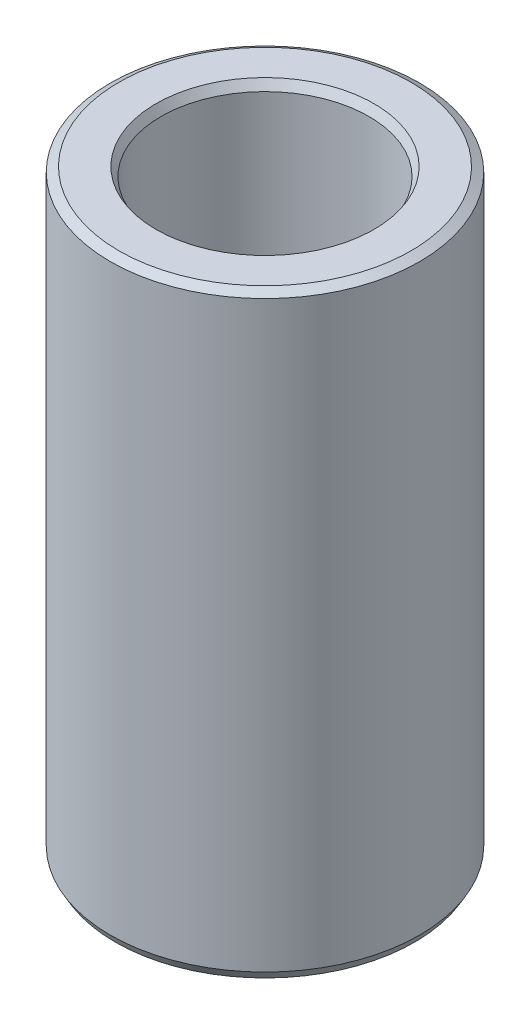
ISO-10303-21;
HEADER;
FILE_DESCRIPTION(('STEP AP214'),'2;1');
FILE_NAME('part.step','',(''),(''),'','','');
FILE_SCHEMA(('AUTOMOTIVE_DESIGN { 1 0 10303 214 1 1 1 1 }'));
ENDSEC;
DATA;
#1=APPLICATION_CONTEXT('core data for automotive mechanical design processes');
#2=APPLICATION_PROTOCOL_DEFINITION('international standard','automotive_design',2000,#1);
#3=PRODUCT_CONTEXT('',#1,'mechanical');
#4=PRODUCT('Part','Part','',(#3));
#5=PRODUCT_RELATED_PRODUCT_CATEGORY('part','',(#4));
#6=PRODUCT_DEFINITION_FORMATION('','',#4);
#7=PRODUCT_DEFINITION_CONTEXT('part definition',#1,'design');
#8=PRODUCT_DEFINITION('design','',#6,#7);
#9=PRODUCT_DEFINITION_SHAPE('','',#8);
#10=(LENGTH_UNIT() NAMED_UNIT(*) SI_UNIT(.MILLI.,.METRE.));
#11=(NAMED_UNIT(*) PLANE_ANGLE_UNIT() SI_UNIT($,.RADIAN.));
#12=(NAMED_UNIT(*) SI_UNIT($,.STERADIAN.) SOLID_ANGLE_UNIT());
#13=UNCERTAINTY_MEASURE_WITH_UNIT(LENGTH_MEASURE(1.E-05),#10,'distance_accuracy_value','');
#14=(GEOMETRIC_REPRESENTATION_CONTEXT(3) GLOBAL_UNCERTAINTY_ASSIGNED_CONTEXT((#13)) GLOBAL_UNIT_ASSIGNED_CONTEXT((#10,
#11,#12)) REPRESENTATION_CONTEXT('',''));
#15=CARTESIAN_POINT('',(0.,0.,0.));
#16=DIRECTION('',(0.,0.,1.));
#17=DIRECTION('',(1.,0.,0.));
#18=AXIS2_PLACEMENT_3D('',#15,#16,#17);
#19=CARTESIAN_POINT('',(0.,135.057837011946,0.));
#20=DIRECTION('',(0.,-1.,0.));
#21=DIRECTION('',(0.,0.,-1.));
#22=AXIS2_PLACEMENT_3D('',#19,#20,#21);
#23=CYLINDRICAL_SURFACE('',#22,35.);
#24=CARTESIAN_POINT('',(0.,1.95623884820872,0.));
#25=DIRECTION('',(0.,1.,0.));
#26=DIRECTION('',(0.,0.,1.));
#27=AXIS2_PLACEMENT_3D('',#24,#25,#26);
#28=CIRCLE('',#27,35.);
#29=CARTESIAN_POINT('',(0.,1.95623884820872,35.));
#30=VERTEX_POINT('',#29);
#31=EDGE_CURVE('E10',#30,#30,#28,.T.);
#32=ORIENTED_EDGE('',*,*,#31,.T.);
#33=EDGE_LOOP('',(#32));
#34=FACE_BOUND('',#33,.T.);
#35=CARTESIAN_POINT('',(0.,133.928401986333,0.));
#36=DIRECTION('',(0.,1.,0.));
#37=DIRECTION('',(0.,0.,1.));
#38=AXIS2_PLACEMENT_3D('',#35,#36,#37);
#39=CIRCLE('',#38,35.);
#40=CARTESIAN_POINT('',(0.,133.928401986333,-35.));
#41=VERTEX_POINT('',#40);
#42=EDGE_CURVE('E50',#41,#41,#39,.F.);
#43=ORIENTED_EDGE('',*,*,#42,.T.);
#44=EDGE_LOOP('',(#43));
#45=FACE_BOUND('',#44,.T.);
#46=ADVANCED_FACE('F39',(#34,#45),#23,.T.);
#47=CARTESIAN_POINT('',(0.,135.057837011946,0.));
#48=DIRECTION('',(0.,1.,0.));
#49=DIRECTION('',(0.,0.,1.));
#50=AXIS2_PLACEMENT_3D('',#47,#48,#49);
#51=PLANE('',#50);
#52=CARTESIAN_POINT('',(0.,135.057837011946,0.));
#53=DIRECTION('',(0.,1.,0.));
#54=DIRECTION('',(0.,0.,1.));
#55=AXIS2_PLACEMENT_3D('',#52,#53,#54);
#56=CIRCLE('',#55,24.663781412725);
#57=CARTESIAN_POINT('',(0.,135.057837011946,24.663781412725));
#58=VERTEX_POINT('',#57);
#59=EDGE_CURVE('E58',#58,#58,#56,.F.);
#60=ORIENTED_EDGE('',*,*,#59,.T.);
#61=EDGE_LOOP('',(#60));
#62=FACE_BOUND('',#61,.T.);
#63=CARTESIAN_POINT('',(0.,135.057837011946,0.));
#64=DIRECTION('',(0.,1.,0.));
#65=DIRECTION('',(0.,0.,1.));
#66=AXIS2_PLACEMENT_3D('',#63,#64,#65);
#67=CIRCLE('',#66,33.0437611517913);
#68=CARTESIAN_POINT('',(0.,135.057837011946,-33.0437611517913));
#69=VERTEX_POINT('',#68);
#70=EDGE_CURVE('E61',#69,#69,#67,.T.);
#71=ORIENTED_EDGE('',*,*,#70,.T.);
#72=EDGE_LOOP('',(#71));
#73=FACE_BOUND('',#72,.T.);
#74=ADVANCED_FACE('F88',(#62,#73),#51,.T.);
#75=CARTESIAN_POINT('',(0.,0.,0.));
#76=DIRECTION('',(0.,1.,0.));
#77=DIRECTION('',(0.,0.,1.));
#78=AXIS2_PLACEMENT_3D('',#75,#76,#77);
#79=PLANE('',#78);
#80=CARTESIAN_POINT('',(0.,0.,0.));
#81=DIRECTION('',(0.,1.,0.));
#82=DIRECTION('',(0.,0.,1.));
#83=AXIS2_PLACEMENT_3D('',#80,#81,#82);
#84=CIRCLE('',#83,25.4905852353212);
#85=CARTESIAN_POINT('',(0.,0.,25.4905852353212));
#86=VERTEX_POINT('',#85);
#87=EDGE_CURVE('E51',#86,#86,#84,.T.);
#88=ORIENTED_EDGE('',*,*,#87,.T.);
#89=EDGE_LOOP('',(#88));
#90=FACE_BOUND('',#89,.T.);
#91=CARTESIAN_POINT('',(0.,0.,0.));
#92=DIRECTION('',(0.,1.,0.));
#93=DIRECTION('',(0.,0.,1.));
#94=AXIS2_PLACEMENT_3D('',#91,#92,#93);
#95=CIRCLE('',#94,33.8705649743875);
#96=CARTESIAN_POINT('',(0.,0.,33.8705649743875));
#97=VERTEX_POINT('',#96);
#98=EDGE_CURVE('E54',#97,#97,#95,.F.);
#99=ORIENTED_EDGE('',*,*,#98,.T.);
#100=EDGE_LOOP('',(#99));
#101=FACE_BOUND('',#100,.T.);
#102=ADVANCED_FACE('F83',(#90,#101),#79,.F.);
#103=CARTESIAN_POINT('',(0.,135.057837011946,0.));
#104=DIRECTION('',(0.,-1.,0.));
#105=DIRECTION('',(0.,0.,-1.));
#106=AXIS2_PLACEMENT_3D('',#103,#104,#105);
#107=CYLINDRICAL_SURFACE('',#106,23.5343463871125);
#108=CARTESIAN_POINT('',(0.,133.101598163737,0.));
#109=DIRECTION('',(0.,1.,0.));
#110=DIRECTION('',(0.,0.,1.));
#111=AXIS2_PLACEMENT_3D('',#108,#109,#110);
#112=CIRCLE('',#111,23.5343463871125);
#113=CARTESIAN_POINT('',(0.,133.101598163737,23.5343463871125));
#114=VERTEX_POINT('',#113);
#115=EDGE_CURVE('E67',#114,#114,#112,.T.);
#116=ORIENTED_EDGE('',*,*,#115,.T.);
#117=EDGE_LOOP('',(#116));
#118=FACE_BOUND('',#117,.T.);
#119=CARTESIAN_POINT('',(0.,1.12943502561247,0.));
#120=DIRECTION('',(0.,1.,0.));
#121=DIRECTION('',(0.,0.,1.));
#122=AXIS2_PLACEMENT_3D('',#119,#120,#121);
#123=CIRCLE('',#122,23.5343463871125);
#124=CARTESIAN_POINT('',(0.,1.12943502561247,23.5343463871125));
#125=VERTEX_POINT('',#124);
#126=EDGE_CURVE('E69',#125,#125,#123,.F.);
#127=ORIENTED_EDGE('',*,*,#126,.T.);
#128=EDGE_LOOP('',(#127));
#129=FACE_BOUND('',#128,.T.);
#130=ADVANCED_FACE('F71',(#118,#129),#107,.F.);
#131=CARTESIAN_POINT('',(0.,133.101598163737,0.));
#132=DIRECTION('',(0.,1.,0.));
#133=DIRECTION('',(0.,0.,1.));
#134=AXIS2_PLACEMENT_3D('',#131,#132,#133);
#135=CONICAL_SURFACE('',#134,23.5343463871125,0.523598775598306);
#136=ORIENTED_EDGE('',*,*,#59,.F.);
#137=EDGE_LOOP('',(#136));
#138=FACE_BOUND('',#137,.T.);
#139=ORIENTED_EDGE('',*,*,#115,.F.);
#140=EDGE_LOOP('',(#139));
#141=FACE_BOUND('',#140,.T.);
#142=ADVANCED_FACE('F77',(#138,#141),#135,.F.);
#143=CARTESIAN_POINT('',(0.,0.,0.));
#144=DIRECTION('',(0.,-1.,0.));
#145=DIRECTION('',(0.,0.,-1.));
#146=AXIS2_PLACEMENT_3D('',#143,#144,#145);
#147=CONICAL_SURFACE('',#146,25.4905852353212,1.0471975511966);
#148=ORIENTED_EDGE('',*,*,#126,.F.);
#149=EDGE_LOOP('',(#148));
#150=FACE_BOUND('',#149,.T.);
#151=ORIENTED_EDGE('',*,*,#87,.F.);
#152=EDGE_LOOP('',(#151));
#153=FACE_BOUND('',#152,.T.);
#154=ADVANCED_FACE('F73',(#150,#153),#147,.F.);
#155=CARTESIAN_POINT('',(0.,1.95623884820872,0.));
#156=DIRECTION('',(0.,1.,0.));
#157=DIRECTION('',(0.,0.,1.));
#158=AXIS2_PLACEMENT_3D('',#155,#156,#157);
#159=CONICAL_SURFACE('',#158,35.,0.523598775598301);
#160=ORIENTED_EDGE('',*,*,#98,.F.);
#161=EDGE_LOOP('',(#160));
#162=FACE_BOUND('',#161,.T.);
#163=ORIENTED_EDGE('',*,*,#31,.F.);
#164=EDGE_LOOP('',(#163));
#165=FACE_BOUND('',#164,.T.);
#166=ADVANCED_FACE('F76',(#162,#165),#159,.T.);
#167=CARTESIAN_POINT('',(0.,135.057837011946,0.));
#168=DIRECTION('',(0.,-1.,0.));
#169=DIRECTION('',(0.,0.,-1.));
#170=AXIS2_PLACEMENT_3D('',#167,#168,#169);
#171=CONICAL_SURFACE('',#170,33.0437611517913,1.04719755119659);
#172=CARTESIAN_POINT('',(0.,133.928401986333,-35.));
#173=CARTESIAN_POINT('',(0.,133.940166934517,-34.9796225119979));
#174=CARTESIAN_POINT('',(0.,133.9519318827,-34.9592450239957));
#175=CARTESIAN_POINT('',(0.,133.975461779067,-34.9184900479913));
#176=CARTESIAN_POINT('',(0.,133.987226727251,-34.8981125599892));
#177=CARTESIAN_POINT('',(0.,134.010756623618,-34.8573575839848));
#178=CARTESIAN_POINT('',(0.,134.022521571801,-34.8369800959826));
#179=CARTESIAN_POINT('',(0.,134.046051468168,-34.7962251199783));
#180=CARTESIAN_POINT('',(0.,134.057816416351,-34.7758476319761));
#181=CARTESIAN_POINT('',(0.,134.081346312718,-34.7350926559718));
#182=CARTESIAN_POINT('',(0.,134.093111260902,-34.7147151679696));
#183=CARTESIAN_POINT('',(0.,134.116641157269,-34.6739601919653));
#184=CARTESIAN_POINT('',(0.,134.128406105452,-34.6535827039631));
#185=CARTESIAN_POINT('',(0.,134.151936001819,-34.6128277279587));
#186=CARTESIAN_POINT('',(0.,134.163700950003,-34.5924502399566));
#187=CARTESIAN_POINT('',(0.,134.18723084637,-34.5516952639522));
#188=CARTESIAN_POINT('',(0.,134.198995794553,-34.53131777595));
#189=CARTESIAN_POINT('',(0.,134.22252569092,-34.4905627999457));
#190=CARTESIAN_POINT('',(0.,134.234290639103,-34.4701853119435));
#191=CARTESIAN_POINT('',(0.,134.25782053547,-34.4294303359392));
#192=CARTESIAN_POINT('',(0.,134.269585483654,-34.409052847937));
#193=CARTESIAN_POINT('',(0.,134.293115380021,-34.3682978719326));
#194=CARTESIAN_POINT('',(0.,134.304880328204,-34.3479203839305));
#195=CARTESIAN_POINT('',(0.,134.328410224571,-34.3071654079261));
#196=CARTESIAN_POINT('',(0.,134.340175172755,-34.2867879199239));
#197=CARTESIAN_POINT('',(0.,134.363705069121,-34.2460329439196));
#198=CARTESIAN_POINT('',(0.,134.375470017305,-34.2256554559174));
#199=CARTESIAN_POINT('',(0.,134.398999913672,-34.1849004799131));
#200=CARTESIAN_POINT('',(0.,134.410764861855,-34.1645229919109));
#201=CARTESIAN_POINT('',(0.,134.434294758222,-34.1237680159065));
#202=CARTESIAN_POINT('',(0.,134.446059706406,-34.1033905279044));
#203=CARTESIAN_POINT('',(0.,134.469589602773,-34.0626355519));
#204=CARTESIAN_POINT('',(0.,134.481354550956,-34.0422580638979));
#205=CARTESIAN_POINT('',(0.,134.504884447323,-34.0015030878935));
#206=CARTESIAN_POINT('',(0.,134.516649395506,-33.9811255998913));
#207=CARTESIAN_POINT('',(0.,134.540179291873,-33.940370623887));
#208=CARTESIAN_POINT('',(0.,134.551944240057,-33.9199931358848));
#209=CARTESIAN_POINT('',(0.,134.575474136424,-33.8792381598805));
#210=CARTESIAN_POINT('',(0.,134.587239084607,-33.8588606718783));
#211=CARTESIAN_POINT('',(0.,134.610768980974,-33.8181056958739));
#212=CARTESIAN_POINT('',(0.,134.622533929158,-33.7977282078718));
#213=CARTESIAN_POINT('',(0.,134.646063825525,-33.7569732318674));
#214=CARTESIAN_POINT('',(0.,134.657828773708,-33.7365957438653));
#215=CARTESIAN_POINT('',(0.,134.681358670075,-33.6958407678609));
#216=CARTESIAN_POINT('',(0.,134.693123618258,-33.6754632798587));
#217=CARTESIAN_POINT('',(0.,134.716653514625,-33.6347083038544));
#218=CARTESIAN_POINT('',(0.,134.728418462809,-33.6143308158522));
#219=CARTESIAN_POINT('',(0.,134.751948359176,-33.5735758398479));
#220=CARTESIAN_POINT('',(0.,134.763713307359,-33.5531983518457));
#221=CARTESIAN_POINT('',(0.,134.787243203726,-33.5124433758413));
#222=CARTESIAN_POINT('',(0.,134.79900815191,-33.4920658878392));
#223=CARTESIAN_POINT('',(0.,134.822538048277,-33.4513109118348));
#224=CARTESIAN_POINT('',(0.,134.83430299646,-33.4309334238326));
#225=CARTESIAN_POINT('',(0.,134.857832892827,-33.3901784478283));
#226=CARTESIAN_POINT('',(0.,134.86959784101,-33.3698009598261));
#227=CARTESIAN_POINT('',(0.,134.893127737377,-33.3290459838218));
#228=CARTESIAN_POINT('',(0.,134.904892685561,-33.3086684958196));
#229=CARTESIAN_POINT('',(0.,134.928422581928,-33.2679135198152));
#230=CARTESIAN_POINT('',(0.,134.940187530111,-33.2475360318131));
#231=CARTESIAN_POINT('',(0.,134.963717426478,-33.2067810558087));
#232=CARTESIAN_POINT('',(0.,134.975482374662,-33.1864035678066));
#233=CARTESIAN_POINT('',(0.,134.999012271029,-33.1456485918022));
#234=CARTESIAN_POINT('',(0.,135.010777219212,-33.1252711038));
#235=CARTESIAN_POINT('',(0.,135.034307115579,-33.0845161277957));
#236=CARTESIAN_POINT('',(0.,135.046072063762,-33.0641386397935));
#237=CARTESIAN_POINT('',(0.,135.057837011946,-33.0437611517913));
#238=B_SPLINE_CURVE_WITH_KNOTS('',3,(#172,#173,#174,#175,#176,#177,#178,#179,#180,#181,#182,
#183,#184,#185,#186,#187,#188,#189,#190,#191,#192,#193,#194,#195,#196,#197,#198,#199,#200,#201,
#202,#203,#204,#205,#206,#207,#208,#209,#210,#211,#212,#213,#214,#215,#216,#217,#218,#219,#220,
#221,#222,#223,#224,#225,#226,#227,#228,#229,#230,#231,#232,#233,#234,#235,#236,#237),
.UNSPECIFIED.,.F.,.F.,(4,2,2,2,2,2,2,2,2,2,2,2,2,2,2,2,2,2,2,2,2,2,2,2,2,2,2,2,2,2,2,2,4),(0.,
0.070589689100786,0.141179378201566,0.211769067302352,0.282358756403132,0.352948445503912,
0.423538134604698,0.494127823705478,0.564717512806264,0.635307201907044,0.70589689100783,
0.77648658010861,0.84707626920939,0.917665958310176,0.988255647410956,1.05884533651174,
1.12943502561251,1.20002471471329,1.27061440381407,1.34120409291485,1.41179378201564,
1.48238347111642,1.5529731602172,1.62356284931799,1.69415253841877,1.76474222751955,
1.83533191662033,1.90592160572111,1.9765112948219,2.04710098392268,2.11769067302346,
2.18828036212424,2.25887005122503),.UNSPECIFIED.);
#239=EDGE_CURVE('BSEAM45',#41,#69,#238,.T.);
#240=ORIENTED_EDGE('',*,*,#42,.F.);
#241=ORIENTED_EDGE('',*,*,#70,.F.);
#242=ORIENTED_EDGE('',*,*,#239,.T.);
#243=ORIENTED_EDGE('',*,*,#239,.F.);
#244=EDGE_LOOP('',(#240,#242,#241,#243));
#245=FACE_BOUND('',#244,.T.);
#246=ADVANCED_FACE('F45',(#245),#171,.T.);
#247=CLOSED_SHELL('',(#46,#74,#102,#130,#142,#154,#166,#246));
#248=MANIFOLD_SOLID_BREP('B2',#247);
#249=ADVANCED_BREP_SHAPE_REPRESENTATION('',(#18,#248),#14);
#250=SHAPE_DEFINITION_REPRESENTATION(#9,#249);
ENDSEC;
END-ISO-10303-21;
